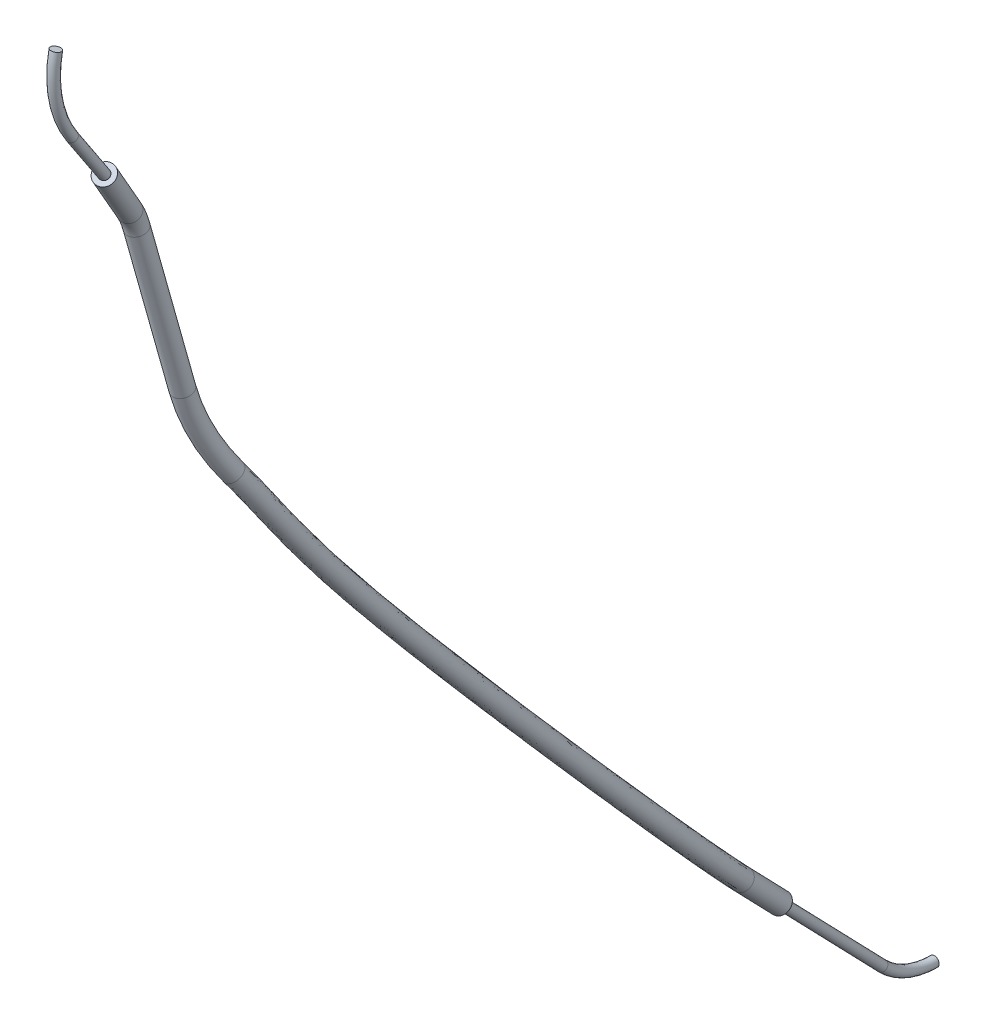
ISO-10303-21;
HEADER;
FILE_DESCRIPTION(('STEP AP214'),'2;1');
FILE_NAME('part.step','',(''),(''),'','','');
FILE_SCHEMA(('AUTOMOTIVE_DESIGN { 1 0 10303 214 1 1 1 1 }'));
ENDSEC;
DATA;
#1=APPLICATION_CONTEXT('core data for automotive mechanical design processes');
#2=APPLICATION_PROTOCOL_DEFINITION('international standard','automotive_design',2000,#1);
#3=PRODUCT_CONTEXT('',#1,'mechanical');
#4=PRODUCT('Part','Part','',(#3));
#5=PRODUCT_RELATED_PRODUCT_CATEGORY('part','',(#4));
#6=PRODUCT_DEFINITION_FORMATION('','',#4);
#7=PRODUCT_DEFINITION_CONTEXT('part definition',#1,'design');
#8=PRODUCT_DEFINITION('design','',#6,#7);
#9=PRODUCT_DEFINITION_SHAPE('','',#8);
#10=(LENGTH_UNIT() NAMED_UNIT(*) SI_UNIT(.MILLI.,.METRE.));
#11=(NAMED_UNIT(*) PLANE_ANGLE_UNIT() SI_UNIT($,.RADIAN.));
#12=(NAMED_UNIT(*) SI_UNIT($,.STERADIAN.) SOLID_ANGLE_UNIT());
#13=UNCERTAINTY_MEASURE_WITH_UNIT(LENGTH_MEASURE(1.E-05),#10,'distance_accuracy_value','');
#14=(GEOMETRIC_REPRESENTATION_CONTEXT(3) GLOBAL_UNCERTAINTY_ASSIGNED_CONTEXT((#13)) GLOBAL_UNIT_ASSIGNED_CONTEXT((#10,
#11,#12)) REPRESENTATION_CONTEXT('',''));
#15=CARTESIAN_POINT('',(0.,0.,0.));
#16=DIRECTION('',(0.,0.,1.));
#17=DIRECTION('',(1.,0.,0.));
#18=AXIS2_PLACEMENT_3D('',#15,#16,#17);
#19=CARTESIAN_POINT('',(0.,13.1111593528472,15.8448605333265));
#20=DIRECTION('',(0.,-0.719339800338635,-0.694658370459015));
#21=DIRECTION('',(0.,0.694658370459014,-0.719339800338635));
#22=AXIS2_PLACEMENT_3D('',#19,#20,#21);
#23=PLANE('',#22);
#24=CARTESIAN_POINT('',(0.,13.1111593528482,15.8448605333255));
#25=DIRECTION('',(0.,-0.719339800338635,-0.694658370459015));
#26=DIRECTION('',(0.,0.694658370459014,-0.719339800338635));
#27=AXIS2_PLACEMENT_3D('',#24,#25,#26);
#28=CIRCLE('',#27,0.5);
#29=CARTESIAN_POINT('',(0.,13.4584885380777,15.4851906331562));
#30=VERTEX_POINT('',#29);
#31=EDGE_CURVE('E49',#30,#30,#28,.T.);
#32=ORIENTED_EDGE('',*,*,#31,.F.);
#33=EDGE_LOOP('',(#32));
#34=FACE_BOUND('',#33,.T.);
#35=CARTESIAN_POINT('',(0.,13.1111593528472,15.8448605333265));
#36=DIRECTION('',(0.,-0.719339800338635,-0.694658370459015));
#37=DIRECTION('',(0.,0.694658370459014,-0.719339800338635));
#38=AXIS2_PLACEMENT_3D('',#35,#36,#37);
#39=CIRCLE('',#38,0.999999999999511);
#40=CARTESIAN_POINT('',(0.,13.8058177233058,15.1255207329882));
#41=VERTEX_POINT('',#40);
#42=EDGE_CURVE('E153',#41,#41,#39,.T.);
#43=ORIENTED_EDGE('',*,*,#42,.T.);
#44=EDGE_LOOP('',(#43));
#45=FACE_BOUND('',#44,.T.);
#46=ADVANCED_FACE('F45',(#34,#45),#23,.T.);
#47=CARTESIAN_POINT('',(-11.375,101.470537020685,74.0497627042893));
#48=DIRECTION('',(-0.173648177666929,-0.821217222698679,-0.543551822309542));
#49=DIRECTION('',(0.0943584669955078,0.535523513641116,-0.839232414795645));
#50=AXIS2_PLACEMENT_3D('',#47,#48,#49);
#51=PLANE('',#50);
#52=CARTESIAN_POINT('',(-11.3749999999999,101.470537020686,74.0497627042881));
#53=DIRECTION('',(-0.173648177666929,-0.821217222698679,-0.543551822309542));
#54=DIRECTION('',(0.984807753012208,-0.144802753384302,-0.0958428516863435));
#55=AXIS2_PLACEMENT_3D('',#52,#53,#54);
#56=ELLIPSE('',#55,0.507713305942873,0.5);
#57=CARTESIAN_POINT('',(-11.3750000000001,101.19456852803,74.4667056153217));
#58=VERTEX_POINT('',#57);
#59=CARTESIAN_POINT('',(-11.375,101.746505513342,73.6328197932546));
#60=VERTEX_POINT('',#59);
#61=EDGE_CURVE('E13',#58,#60,#56,.T.);
#62=ORIENTED_EDGE('',*,*,#61,.T.);
#63=CARTESIAN_POINT('',(-11.3749999999999,101.470537020686,74.0497627042881));
#64=DIRECTION('',(-0.173648177666929,-0.821217222698679,-0.543551822309542));
#65=DIRECTION('',(0.,0.5519369853121,-0.83388582206714));
#66=AXIS2_PLACEMENT_3D('',#63,#64,#65);
#67=CIRCLE('',#66,0.5);
#68=EDGE_CURVE('E85',#60,#58,#67,.T.);
#69=ORIENTED_EDGE('',*,*,#68,.T.);
#70=EDGE_LOOP('',(#62,#69));
#71=FACE_BOUND('',#70,.T.);
#72=CARTESIAN_POINT('',(-11.375,101.470537020685,74.0497627042893));
#73=DIRECTION('',(-0.173648177666929,-0.821217222698679,-0.543551822309542));
#74=DIRECTION('',(0.0943584669955078,0.535523513641116,-0.839232414795645));
#75=AXIS2_PLACEMENT_3D('',#72,#73,#74);
#76=CIRCLE('',#75,0.999999999999511);
#77=CARTESIAN_POINT('',(-11.2806415330046,102.006060534326,73.2105302894941));
#78=VERTEX_POINT('',#77);
#79=EDGE_CURVE('E81',#78,#78,#76,.T.);
#80=ORIENTED_EDGE('',*,*,#79,.F.);
#81=EDGE_LOOP('',(#80));
#82=FACE_BOUND('',#81,.T.);
#83=ADVANCED_FACE('F140',(#71,#82),#51,.F.);
#84=CARTESIAN_POINT('',(0.,13.1111593528472,15.8448605333265));
#85=DIRECTION('',(0.,0.719339800338642,0.694658370459007));
#86=DIRECTION('',(0.,-0.694658370459007,0.719339800338642));
#87=AXIS2_PLACEMENT_3D('',#84,#85,#86);
#88=CYLINDRICAL_SURFACE('',#87,0.999999999999511);
#89=CARTESIAN_POINT('',(0.,17.170747436117,19.7651591756809));
#90=DIRECTION('',(0.,-0.719339800338635,-0.694658370459015));
#91=DIRECTION('',(0.,0.694658370459014,-0.719339800338635));
#92=AXIS2_PLACEMENT_3D('',#89,#90,#91);
#93=CIRCLE('',#92,0.999999999999511);
#94=CARTESIAN_POINT('',(0.,17.8654058065757,19.0458193753426));
#95=VERTEX_POINT('',#94);
#96=EDGE_CURVE('E155',#95,#95,#93,.T.);
#97=ORIENTED_EDGE('',*,*,#96,.T.);
#98=EDGE_LOOP('',(#97));
#99=FACE_BOUND('',#98,.T.);
#100=ORIENTED_EDGE('',*,*,#42,.F.);
#101=EDGE_LOOP('',(#100));
#102=FACE_BOUND('',#101,.T.);
#103=ADVANCED_FACE('F143',(#99,#102),#88,.T.);
#104=CARTESIAN_POINT('',(0.,17.8654058065757,19.0458193753426));
#105=CARTESIAN_POINT('',(0.,18.0799133459049,19.2529668981844));
#106=CARTESIAN_POINT('',(-0.00749146107605446,18.3077487449941,19.4698881451671));
#107=CARTESIAN_POINT('',(-0.0358580609070674,18.7965767756348,19.9301346253102));
#108=CARTESIAN_POINT('',(-0.0567342490146542,19.0557707906016,20.171722533152));
#109=CARTESIAN_POINT('',(-0.137177252180344,19.8716222228172,20.9258430646425));
#110=CARTESIAN_POINT('',(-0.214530932234064,20.4664565945145,21.46765020807));
#111=CARTESIAN_POINT('',(-0.500708798210788,22.3578028106722,23.1721953552096));
#112=CARTESIAN_POINT('',(-0.763482930006202,23.7634680288247,24.4163089960345));
#113=CARTESIAN_POINT('',(-1.66699011878649,28.1664198806543,28.2697581724947));
#114=CARTESIAN_POINT('',(-2.41951925371011,31.3486105813104,31.0003617954818));
#115=CARTESIAN_POINT('',(-4.68922980220798,40.6278683157976,38.8674219982044));
#116=CARTESIAN_POINT('',(-6.24090831226144,46.5452781294316,43.7604300346031));
#117=CARTESIAN_POINT('',(-8.29703948873135,55.2601616106186,50.7057083676437));
#118=CARTESIAN_POINT('',(-8.89188787445537,58.3411488256507,53.0093120536888));
#119=CARTESIAN_POINT('',(-9.6321193444375,62.3237651472189,55.7680985954605));
#120=CARTESIAN_POINT('',(-9.8542073899737,63.547332719236,56.5720305822303));
#121=CARTESIAN_POINT('',(-10.2592659521528,65.4262720578813,57.776392084434));
#122=CARTESIAN_POINT('',(-10.4065375133106,66.0595425383804,58.1777555696156));
#123=CARTESIAN_POINT('',(-10.6730524721802,67.0761928683995,58.8265252424002));
#124=CARTESIAN_POINT('',(-10.7695712818076,67.426152247486,59.0505930960422));
#125=CARTESIAN_POINT('',(-10.9297224020711,67.9741967049277,59.4045179952518));
#126=CARTESIAN_POINT('',(-10.985671323153,68.1607243945093,59.5254650735618));
#127=CARTESIAN_POINT('',(-11.10334186882,68.5425078979222,59.7743409124543));
#128=CARTESIAN_POINT('',(-11.1663895500006,68.7418466666541,59.9049618264803));
#129=CARTESIAN_POINT('',(-11.2299947849779,68.9378878999835,60.0342120072733));
#130=CARTESIAN_POINT('',(1.99999999999902,17.8654058065757,19.0458193753426));
#131=CARTESIAN_POINT('',(1.99999999999902,18.0920701219509,19.2647065603498));
#132=CARTESIAN_POINT('',(1.99171482882098,18.3518051747756,19.512103962075));
#133=CARTESIAN_POINT('',(1.96137023741766,18.8747195847153,20.0044431752558));
#134=CARTESIAN_POINT('',(1.93927996595546,19.1482117186935,20.2593314054861));
#135=CARTESIAN_POINT('',(1.85512604597813,20.0016993247474,21.0482402099578));
#136=CARTESIAN_POINT('',(1.77522239402711,20.6147650894629,21.6065748606663));
#137=CARTESIAN_POINT('',(1.48222847568851,22.5511585645962,23.3517180370856));
#138=CARTESIAN_POINT('',(1.21588576517648,23.9743286520974,24.6111844922362));
#139=CARTESIAN_POINT('',(0.303947956499712,28.4183647038713,28.5005898888944));
#140=CARTESIAN_POINT('',(-0.451541054799335,31.6119624782822,31.2408201229174));
#141=CARTESIAN_POINT('',(-2.72709069545169,40.9150929287244,39.1281184279889));
#142=CARTESIAN_POINT('',(-4.27946366370087,46.8358628555906,44.0233366525643));
#143=CARTESIAN_POINT('',(-6.32566561722083,55.508661463589,50.9350756768151));
#144=CARTESIAN_POINT('',(-6.91488705899755,58.5605828219199,53.2174615689979));
#145=CARTESIAN_POINT('',(-7.65582513216861,62.5469965710675,55.978886045005));
#146=CARTESIAN_POINT('',(-7.8799272842074,63.7832748935517,56.7915631698015));
#147=CARTESIAN_POINT('',(-8.29585167078003,65.7126015869154,58.0282473225595));
#148=CARTESIAN_POINT('',(-8.44810087503084,66.3675334560869,58.4433541624192));
#149=CARTESIAN_POINT('',(-8.72419136365745,67.4206993766711,59.1154446366712));
#150=CARTESIAN_POINT('',(-8.8242391818918,67.7834445817404,59.3477017785631));
#151=CARTESIAN_POINT('',(-8.99002624380742,68.3507714676473,59.7140860035596));
#152=CARTESIAN_POINT('',(-9.0479093668769,68.5437435998558,59.8392116683875));
#153=CARTESIAN_POINT('',(-9.16951823115978,68.9383021725637,60.096420199611));
#154=CARTESIAN_POINT('',(-9.23714074248978,69.1518961007432,60.2364177311673));
#155=CARTESIAN_POINT('',(-9.30019034096967,69.3462247759119,60.3645388206557));
#156=CARTESIAN_POINT('',(1.99999999999902,16.4760890656584,20.4844989760192));
#157=CARTESIAN_POINT('',(1.99999999999902,16.7063679904558,20.7068767487707));
#158=CARTESIAN_POINT('',(1.99147868370641,16.975637590795,20.9633836796663));
#159=CARTESIAN_POINT('',(1.96053702693069,17.5088489561556,21.4654177902103));
#160=CARTESIAN_POINT('',(1.93807721931826,17.786705077923,21.7243658981411));
#161=CARTESIAN_POINT('',(1.85278021707493,18.6517871778568,22.5239919063525));
#162=CARTESIAN_POINT('',(1.77207369825999,19.2706294857348,23.0875654483022));
#163=CARTESIAN_POINT('',(1.4768683808729,21.2216384851036,24.8458806294111));
#164=CARTESIAN_POINT('',(1.20927714493608,22.6510331572573,26.1108160885573));
#165=CARTESIAN_POINT('',(0.294116526438554,27.1107765367347,30.0139684895423));
#166=CARTESIAN_POINT('',(-0.462926649480622,30.3106641908858,32.7595564643571));
#167=CARTESIAN_POINT('',(-2.74297691676848,39.632199177327,40.6624583538728));
#168=CARTESIAN_POINT('',(-4.29751529057615,45.5604047019331,45.5641120559931));
#169=CARTESIAN_POINT('',(-6.35522882551133,54.2819949920938,52.5147353423174));
#170=CARTESIAN_POINT('',(-6.95201196096079,57.3705610753969,54.8254531871227));
#171=CARTESIAN_POINT('',(-7.70570581561108,61.4255704307978,57.6343941525733));
#172=CARTESIAN_POINT('',(-7.93443515065044,62.6862058726061,58.4629705333535));
#173=CARTESIAN_POINT('',(-8.353482808576,64.6299195664686,59.7088757241867));
#174=CARTESIAN_POINT('',(-8.5060327066885,65.2856727437063,60.1244986643255));
#175=CARTESIAN_POINT('',(-8.7805028907963,66.3325970379448,60.7926055400863));
#176=CARTESIAN_POINT('',(-8.8796592642708,66.6920488358835,61.0227577298989));
#177=CARTESIAN_POINT('',(-9.04354276460572,67.2528416817003,61.38492210924));
#178=CARTESIAN_POINT('',(-9.10069516297291,67.4433742718581,61.5084665278113));
#179=CARTESIAN_POINT('',(-9.22066605368021,67.8326047585894,61.7622016717539));
#180=CARTESIAN_POINT('',(-9.28472984778983,68.0351438913845,61.8949230448606));
#181=CARTESIAN_POINT('',(-9.34943499238236,68.2345752173314,62.0264083170998));
#182=CARTESIAN_POINT('',(0.,16.4760890656584,20.4844989760192));
#183=CARTESIAN_POINT('',(0.,16.6942112144098,20.6951370866053));
#184=CARTESIAN_POINT('',(-0.00772760619062775,16.9315811610134,20.9211678627581));
#185=CARTESIAN_POINT('',(-0.036691271394035,17.4307061470751,21.3911092402649));
#186=CARTESIAN_POINT('',(-0.0579369956518758,17.6942641498312,21.636757025807));
#187=CARTESIAN_POINT('',(-0.139523081083501,18.5217100759266,22.4015947610373));
#188=CARTESIAN_POINT('',(-0.217679628001466,19.122320990785,22.9486407957066));
#189=CARTESIAN_POINT('',(-0.506068893025839,21.0282827311825,24.6663579475336));
#190=CARTESIAN_POINT('',(-0.770091550245744,22.4401725339846,25.9159405923556));
#191=CARTESIAN_POINT('',(-1.67682154884936,26.8588317135178,29.7831367731426));
#192=CARTESIAN_POINT('',(-2.43090484839072,30.0473122939139,32.5190981369143));
#193=CARTESIAN_POINT('',(-4.70511602352611,39.3449745644002,40.4017619241025));
#194=CARTESIAN_POINT('',(-6.25895993913415,45.2698199757741,45.3012054380421));
#195=CARTESIAN_POINT('',(-8.3266026970242,54.0334951391234,52.2853680331367));
#196=CARTESIAN_POINT('',(-8.9290127764179,57.151127079122,54.6173036718137));
#197=CARTESIAN_POINT('',(-9.68200002788032,61.2023390069521,57.4236067030288));
#198=CARTESIAN_POINT('',(-9.90871525641674,62.4502636982852,58.2434379457796));
#199=CARTESIAN_POINT('',(-10.3168970899487,64.3435900374371,59.4570204860624));
#200=CARTESIAN_POINT('',(-10.4644693449679,64.9776818259999,59.8589000715234));
#201=CARTESIAN_POINT('',(-10.7293639993192,65.9880905296733,60.5036861458146));
#202=CARTESIAN_POINT('',(-10.8249913641868,66.3347565016291,60.7256490473787));
#203=CARTESIAN_POINT('',(-10.9832389228693,66.8762669189806,61.0753541009318));
#204=CARTESIAN_POINT('',(-11.0384571192489,67.0603550665124,61.1947199329852));
#205=CARTESIAN_POINT('',(-11.1544896913405,67.4368104839471,61.4401223845976));
#206=CARTESIAN_POINT('',(-11.2139786553006,67.6250944572954,61.5634671401736));
#207=CARTESIAN_POINT('',(-11.2792394363906,67.826238341403,61.6960815037174));
#208=CARTESIAN_POINT('',(-1.99999999999902,16.4760890656584,20.4844989760192));
#209=CARTESIAN_POINT('',(-1.99999999999902,16.6820544383639,20.6833974244399));
#210=CARTESIAN_POINT('',(-2.00693389608766,16.8875247312318,20.8789520458499));
#211=CARTESIAN_POINT('',(-2.03391956971876,17.3525633379946,21.3168006903196));
#212=CARTESIAN_POINT('',(-2.05395121062201,17.6018232217393,21.5491481534729));
#213=CARTESIAN_POINT('',(-2.13182637924193,18.3916329739964,22.279197615722));
#214=CARTESIAN_POINT('',(-2.20743295426292,18.9740124958351,22.809716143111));
#215=CARTESIAN_POINT('',(-2.48900616692458,20.8349269772614,24.4868352656562));
#216=CARTESIAN_POINT('',(-2.74946024542757,22.2293119107118,25.7210650961539));
#217=CARTESIAN_POINT('',(-3.64775962413727,26.6068868903008,29.5523050567429));
#218=CARTESIAN_POINT('',(-4.39888304730082,29.7839603969421,32.2786398094715));
#219=CARTESIAN_POINT('',(-6.66725513028375,39.0577499514734,40.1410654943323));
#220=CARTESIAN_POINT('',(-8.22040458769214,44.979235249615,45.0382988200912));
#221=CARTESIAN_POINT('',(-10.2979765685371,53.7849952861529,52.056000723956));
#222=CARTESIAN_POINT('',(-10.906013591875,56.9316930828471,54.4091541565046));
#223=CARTESIAN_POINT('',(-11.6582942401496,60.9791075831064,57.2128192534843));
#224=CARTESIAN_POINT('',(-11.882995362183,62.2143215239642,58.0239053582058));
#225=CARTESIAN_POINT('',(-12.2803113713215,64.0572605084057,59.2051652479382));
#226=CARTESIAN_POINT('',(-12.4229059832473,64.6696909082934,59.5933014787212));
#227=CARTESIAN_POINT('',(-12.6782251078422,65.6435840214018,60.2147667515428));
#228=CARTESIAN_POINT('',(-12.7703234641028,65.9774641673746,60.4285403648586));
#229=CARTESIAN_POINT('',(-12.9229350811328,66.499692156261,60.7657860926236));
#230=CARTESIAN_POINT('',(-12.9762190755248,66.6773358611668,60.8809733381591));
#231=CARTESIAN_POINT('',(-13.0883133290008,67.0410162093048,61.1180430974414));
#232=CARTESIAN_POINT('',(-13.1432274628115,67.2150450232062,61.2320112354866));
#233=CARTESIAN_POINT('',(-13.2090438803988,67.4179014654747,61.365754690335));
#234=CARTESIAN_POINT('',(-1.99999999999902,17.8654058065757,19.0458193753426));
#235=CARTESIAN_POINT('',(-1.99999999999902,18.067756569859,19.2412272360189));
#236=CARTESIAN_POINT('',(-2.00669775097309,18.2636923152125,19.4276723282592));
#237=CARTESIAN_POINT('',(-2.0330863592318,18.7184339665543,19.8558260753646));
#238=CARTESIAN_POINT('',(-2.05274846398477,18.9633298625097,20.0841136608179));
#239=CARTESIAN_POINT('',(-2.12948055033882,19.741545120887,20.8034459193273));
#240=CARTESIAN_POINT('',(-2.20428425849524,20.3181480995662,21.3287255554736));
#241=CARTESIAN_POINT('',(-2.48364607211009,22.1644470567481,22.9926726733336));
#242=CARTESIAN_POINT('',(-2.74285162518889,23.5526074055519,24.2214334998328));
#243=CARTESIAN_POINT('',(-3.63792819407269,27.9144750574373,28.038926456095));
#244=CARTESIAN_POINT('',(-4.38749745262088,31.0852586843386,30.7599034680462));
#245=CARTESIAN_POINT('',(-6.65136890896428,40.3406437028708,38.6067255684198));
#246=CARTESIAN_POINT('',(-8.20235296082202,46.2546934032725,43.4975234166418));
#247=CARTESIAN_POINT('',(-10.2684133602419,55.0116617576482,50.4763410584724));
#248=CARTESIAN_POINT('',(-10.8688886899132,58.1217148293815,52.8011625383798));
#249=CARTESIAN_POINT('',(-11.6084135567064,62.1005337233704,55.557311145916));
#250=CARTESIAN_POINT('',(-11.82848749574,63.3113905449203,56.3524979946591));
#251=CARTESIAN_POINT('',(-12.2226802335255,65.1399425288473,57.5245368463084));
#252=CARTESIAN_POINT('',(-12.3649741515904,65.751551620674,57.912156976812));
#253=CARTESIAN_POINT('',(-12.621913580703,66.731686360128,58.5376058481292));
#254=CARTESIAN_POINT('',(-12.7149033817234,67.0688599132316,58.7534844135213));
#255=CARTESIAN_POINT('',(-12.8694185603347,67.597621942208,59.094949986944));
#256=CARTESIAN_POINT('',(-12.923433279429,67.7777051891629,59.2117184787361));
#257=CARTESIAN_POINT('',(-13.0371655064802,68.1467136232807,59.4522616252976));
#258=CARTESIAN_POINT('',(-13.0956383575114,68.3317972325649,59.5735059217933));
#259=CARTESIAN_POINT('',(-13.1597992289861,68.5295510240551,59.7038851938909));
#260=CARTESIAN_POINT('',(0.,17.8654058065757,19.0458193753426));
#261=CARTESIAN_POINT('',(0.,18.0799133459049,19.2529668981844));
#262=CARTESIAN_POINT('',(-0.00749146107605446,18.3077487449941,19.4698881451671));
#263=CARTESIAN_POINT('',(-0.0358580609070674,18.7965767756348,19.9301346253102));
#264=CARTESIAN_POINT('',(-0.0567342490146542,19.0557707906016,20.171722533152));
#265=CARTESIAN_POINT('',(-0.137177252180344,19.8716222228172,20.9258430646425));
#266=CARTESIAN_POINT('',(-0.214530932234064,20.4664565945145,21.46765020807));
#267=CARTESIAN_POINT('',(-0.500708798210788,22.3578028106722,23.1721953552096));
#268=CARTESIAN_POINT('',(-0.763482930006202,23.7634680288247,24.4163089960345));
#269=CARTESIAN_POINT('',(-1.66699011878649,28.1664198806543,28.2697581724947));
#270=CARTESIAN_POINT('',(-2.41951925371011,31.3486105813104,31.0003617954818));
#271=CARTESIAN_POINT('',(-4.68922980220798,40.6278683157976,38.8674219982044));
#272=CARTESIAN_POINT('',(-6.24090831226144,46.5452781294316,43.7604300346031));
#273=CARTESIAN_POINT('',(-8.29703948873135,55.2601616106186,50.7057083676437));
#274=CARTESIAN_POINT('',(-8.89188787445537,58.3411488256507,53.0093120536888));
#275=CARTESIAN_POINT('',(-9.6321193444375,62.3237651472189,55.7680985954605));
#276=CARTESIAN_POINT('',(-9.8542073899737,63.547332719236,56.5720305822303));
#277=CARTESIAN_POINT('',(-10.2592659521528,65.4262720578813,57.776392084434));
#278=CARTESIAN_POINT('',(-10.4065375133106,66.0595425383804,58.1777555696156));
#279=CARTESIAN_POINT('',(-10.6730524721802,67.0761928683995,58.8265252424002));
#280=CARTESIAN_POINT('',(-10.7695712818076,67.426152247486,59.0505930960422));
#281=CARTESIAN_POINT('',(-10.9297224020711,67.9741967049277,59.4045179952518));
#282=CARTESIAN_POINT('',(-10.985671323153,68.1607243945093,59.5254650735618));
#283=CARTESIAN_POINT('',(-11.10334186882,68.5425078979222,59.7743409124543));
#284=CARTESIAN_POINT('',(-11.1663895500006,68.7418466666541,59.9049618264803));
#285=CARTESIAN_POINT('',(-11.2299947849779,68.9378878999835,60.0342120072733));
#286=(BOUNDED_SURFACE() B_SPLINE_SURFACE(3,3,((#104,#105,#106,#107,#108,#109,#110,#111,#112,
#113,#114,#115,#116,#117,#118,#119,#120,#121,#122,#123,#124,#125,#126,#127,#128,#129),(#130,
#131,#132,#133,#134,#135,#136,#137,#138,#139,#140,#141,#142,#143,#144,#145,#146,#147,#148,#149,
#150,#151,#152,#153,#154,#155),(#156,#157,#158,#159,#160,#161,#162,#163,#164,#165,#166,#167,
#168,#169,#170,#171,#172,#173,#174,#175,#176,#177,#178,#179,#180,#181),(#182,#183,#184,#185,
#186,#187,#188,#189,#190,#191,#192,#193,#194,#195,#196,#197,#198,#199,#200,#201,#202,#203,#204,
#205,#206,#207),(#208,#209,#210,#211,#212,#213,#214,#215,#216,#217,#218,#219,#220,#221,#222,
#223,#224,#225,#226,#227,#228,#229,#230,#231,#232,#233),(#234,#235,#236,#237,#238,#239,#240,
#241,#242,#243,#244,#245,#246,#247,#248,#249,#250,#251,#252,#253,#254,#255,#256,#257,#258,#259),
(#260,#261,#262,#263,#264,#265,#266,#267,#268,#269,#270,#271,#272,#273,#274,#275,#276,#277,#278,
#279,#280,#281,#282,#283,#284,#285)),.UNSPECIFIED.,.T.,.F.,.F.) B_SPLINE_SURFACE_WITH_KNOTS((4,
3,4),(4,2,2,2,2,2,2,2,2,2,2,2,4),(0.,0.5,1.),(0.0519837529824369,0.0620652435304384,
0.0721467340784399,0.0923097151744429,0.132635677366449,0.213287601750461,0.374591450518485,
0.520702058241909,0.593757362103621,0.630285014034478,0.648548839999906,0.65768075298262,
0.666812665965334),
.UNSPECIFIED.) GEOMETRIC_REPRESENTATION_ITEM() RATIONAL_B_SPLINE_SURFACE(((1.,1.,1.,1.,1.,1.,1.,
1.,1.,1.,1.,1.,1.,1.,1.,1.,1.,1.,1.,1.,1.,1.,1.,1.,1.,1.),(0.333333333333333,0.333333333333333,
0.333333333333333,0.333333333333333,0.333333333333333,0.333333333333333,0.333333333333333,
0.333333333333333,0.333333333333333,0.333333333333333,0.333333333333333,0.333333333333333,
0.333333333333333,0.333333333333333,0.333333333333333,0.333333333333333,0.333333333333333,
0.333333333333333,0.333333333333333,0.333333333333333,0.333333333333333,0.333333333333333,
0.333333333333333,0.333333333333333,0.333333333333333,0.333333333333333),(0.333333333333333,
0.333333333333333,0.333333333333333,0.333333333333333,0.333333333333333,0.333333333333333,
0.333333333333333,0.333333333333333,0.333333333333333,0.333333333333333,0.333333333333333,
0.333333333333333,0.333333333333333,0.333333333333333,0.333333333333333,0.333333333333333,
0.333333333333333,0.333333333333333,0.333333333333333,0.333333333333333,0.333333333333333,
0.333333333333333,0.333333333333333,0.333333333333333,0.333333333333333,0.333333333333333),(1.,
1.,1.,1.,1.,1.,1.,1.,1.,1.,1.,1.,1.,1.,1.,1.,1.,1.,1.,1.,1.,1.,1.,1.,1.,1.),(0.333333333333333,
0.333333333333333,0.333333333333333,0.333333333333333,0.333333333333333,0.333333333333333,
0.333333333333333,0.333333333333333,0.333333333333333,0.333333333333333,0.333333333333333,
0.333333333333333,0.333333333333333,0.333333333333333,0.333333333333333,0.333333333333333,
0.333333333333333,0.333333333333333,0.333333333333333,0.333333333333333,0.333333333333333,
0.333333333333333,0.333333333333333,0.333333333333333,0.333333333333333,0.333333333333333),
(0.333333333333333,0.333333333333333,0.333333333333333,0.333333333333333,0.333333333333333,
0.333333333333333,0.333333333333333,0.333333333333333,0.333333333333333,0.333333333333333,
0.333333333333333,0.333333333333333,0.333333333333333,0.333333333333333,0.333333333333333,
0.333333333333333,0.333333333333333,0.333333333333333,0.333333333333333,0.333333333333333,
0.333333333333333,0.333333333333333,0.333333333333333,0.333333333333333,0.333333333333333,
0.333333333333333),(1.,1.,1.,1.,1.,1.,1.,1.,1.,1.,1.,1.,1.,1.,1.,1.,1.,1.,1.,1.,1.,1.,1.,1.,1.,1.))) REPRESENTATION_ITEM('') SURFACE());
#287=CARTESIAN_POINT('',(-11.2546171106842,68.3820631206933,60.8651467554953));
#288=DIRECTION('',(0.261452563665855,-0.80583749209496,-0.531289462804089));
#289=DIRECTION('',(0.0246223257063602,0.555824779290499,-0.830934748222432));
#290=AXIS2_PLACEMENT_3D('',#287,#288,#289);
#291=CIRCLE('',#290,0.999999999999511);
#292=CARTESIAN_POINT('',(-11.8415274445321,67.8123494933781,61.4404402830731));
#293=VERTEX_POINT('',#292);
#294=EDGE_CURVE('E158',#293,#293,#291,.T.);
#295=ORIENTED_EDGE('',*,*,#294,.T.);
#296=EDGE_LOOP('',(#295));
#297=FACE_BOUND('',#296,.T.);
#298=ORIENTED_EDGE('',*,*,#96,.F.);
#299=EDGE_LOOP('',(#298));
#300=FACE_BOUND('',#299,.T.);
#301=ADVANCED_FACE('F176',(#297,#300),#286,.F.);
#302=CARTESIAN_POINT('',(2.9600173376667,82.1802031183921,46.9318647473102));
#303=DIRECTION('',(-0.766275940490601,0.161407308338699,-0.621907439929851));
#304=DIRECTION('',(-0.630170310861629,0.,0.776456939764568));
#305=AXIS2_PLACEMENT_3D('',#302,#303,#304);
#306=TOROIDAL_SURFACE('',#305,24.2194311951366,0.999999999999511);
#307=CARTESIAN_POINT('',(-12.5991041692694,77.1294630804313,64.7920050160005));
#308=DIRECTION('',(0.0106664618734066,-0.96460271991491,-0.263491592510768));
#309=DIRECTION('',(0.0695400970126404,0.263584174662062,-0.962126580952418));
#310=AXIS2_PLACEMENT_3D('',#307,#308,#309);
#311=CIRCLE('',#310,0.999999999999511);
#312=CARTESIAN_POINT('',(-13.2415272460778,76.920922260572,65.5294352275023));
#313=VERTEX_POINT('',#312);
#314=EDGE_CURVE('E163',#313,#313,#311,.T.);
#315=CARTESIAN_POINT('',(2.9600173376667,82.1802031183921,46.9318647473102));
#316=DIRECTION('',(-0.766275940490601,0.161407308338699,-0.621907439929851));
#317=DIRECTION('',(-0.630170310861629,0.,0.776456939764568));
#318=AXIS2_PLACEMENT_3D('',#315,#316,#317);
#319=CIRCLE('',#318,25.2194311951361);
#320=EDGE_CURVE('',#293,#313,#319,.T.);
#321=ORIENTED_EDGE('',*,*,#294,.F.);
#322=ORIENTED_EDGE('',*,*,#314,.T.);
#323=ORIENTED_EDGE('',*,*,#320,.T.);
#324=ORIENTED_EDGE('',*,*,#320,.F.);
#325=EDGE_LOOP('',(#321,#323,#322,#324));
#326=FACE_BOUND('',#325,.T.);
#327=ADVANCED_FACE('F171',(#326),#306,.T.);
#328=CARTESIAN_POINT('',(-12.5991041692694,77.1294630804313,64.7920050160005));
#329=DIRECTION('',(-0.0106664618734065,0.964602719914913,0.263491592510759));
#330=DIRECTION('',(0.,-0.263506582958254,0.964657597667517));
#331=AXIS2_PLACEMENT_3D('',#328,#329,#330);
#332=CYLINDRICAL_SURFACE('',#331,0.999999999999511);
#333=CARTESIAN_POINT('',(-12.7820804158944,93.6765981350536,69.3120326678172));
#334=DIRECTION('',(0.0106664618734073,-0.96460271991491,-0.263491592510769));
#335=DIRECTION('',(0.0695400970126404,0.263584174662063,-0.962126580952418));
#336=AXIS2_PLACEMENT_3D('',#333,#334,#335);
#337=CIRCLE('',#336,0.999999999999511);
#338=CARTESIAN_POINT('',(-13.2941841543366,93.8976559993902,68.4820427993927));
#339=VERTEX_POINT('',#338);
#340=EDGE_CURVE('E91',#339,#339,#337,.T.);
#341=ORIENTED_EDGE('',*,*,#340,.T.);
#342=EDGE_LOOP('',(#341));
#343=FACE_BOUND('',#342,.T.);
#344=ORIENTED_EDGE('',*,*,#314,.F.);
#345=EDGE_LOOP('',(#344));
#346=FACE_BOUND('',#345,.T.);
#347=ADVANCED_FACE('F135',(#343,#346),#332,.T.);
#348=CARTESIAN_POINT('',(-9.68156335811037,92.3382097819088,74.3371819718753));
#349=DIRECTION('',(0.858857373295688,0.143788084859783,-0.491618753698419));
#350=DIRECTION('',(-0.49678105316397,0.,-0.86787590427278));
#351=AXIS2_PLACEMENT_3D('',#348,#349,#350);
#352=TOROIDAL_SURFACE('',#351,6.05447065708622,0.999999999999511);
#353=CARTESIAN_POINT('',(-12.5991041692694,95.6815017443723,70.218083841645));
#354=DIRECTION('',(-0.173648177666929,-0.82121722269868,-0.54355182230954));
#355=DIRECTION('',(0.0943584669955074,0.535523513641114,-0.839232414795646));
#356=AXIS2_PLACEMENT_3D('',#353,#354,#355);
#357=CIRCLE('',#356,0.999999999999511);
#358=CARTESIAN_POINT('',(-13.0809862323599,96.2337039354175,69.5377439137593));
#359=VERTEX_POINT('',#358);
#360=EDGE_CURVE('E86',#359,#359,#357,.T.);
#361=CARTESIAN_POINT('',(-9.68156335811037,92.3382097819088,74.3371819718753));
#362=DIRECTION('',(0.858857373295688,0.143788084859783,-0.491618753698419));
#363=DIRECTION('',(-0.49678105316397,0.,-0.86787590427278));
#364=AXIS2_PLACEMENT_3D('',#361,#362,#363);
#365=CIRCLE('',#364,7.05447065708574);
#366=EDGE_CURVE('',#339,#359,#365,.T.);
#367=ORIENTED_EDGE('',*,*,#340,.F.);
#368=ORIENTED_EDGE('',*,*,#360,.T.);
#369=ORIENTED_EDGE('',*,*,#366,.T.);
#370=ORIENTED_EDGE('',*,*,#366,.F.);
#371=EDGE_LOOP('',(#367,#369,#368,#370));
#372=FACE_BOUND('',#371,.T.);
#373=ADVANCED_FACE('F128',(#372),#352,.T.);
#374=CARTESIAN_POINT('',(-12.5991041692694,95.6815017443723,70.218083841645));
#375=DIRECTION('',(0.17364817766693,0.821217222698684,0.543551822309533));
#376=DIRECTION('',(0.,-0.551936985312091,0.833885822067146));
#377=AXIS2_PLACEMENT_3D('',#374,#375,#376);
#378=CYLINDRICAL_SURFACE('',#377,0.999999999999511);
#379=ORIENTED_EDGE('',*,*,#79,.T.);
#380=EDGE_LOOP('',(#379));
#381=FACE_BOUND('',#380,.T.);
#382=ORIENTED_EDGE('',*,*,#360,.F.);
#383=EDGE_LOOP('',(#382));
#384=FACE_BOUND('',#383,.T.);
#385=ADVANCED_FACE('F82',(#381,#384),#378,.T.);
#386=CARTESIAN_POINT('',(-11.3749999999999,115.113858529973,79.0408317655282));
#387=DIRECTION('',(0.,0.979924704620835,-0.199367934417172));
#388=DIRECTION('',(0.995399469177943,0.0191017962276908,0.0938883280346435));
#389=AXIS2_PLACEMENT_3D('',#386,#387,#388);
#390=PLANE('',#389);
#391=CARTESIAN_POINT('',(-11.3749999999999,115.113858529973,79.0408317655282));
#392=DIRECTION('',(0.,0.979924704620835,-0.199367934417172));
#393=DIRECTION('',(0.995399469177943,0.0191017962276908,0.0938883280346435));
#394=AXIS2_PLACEMENT_3D('',#391,#392,#393);
#395=CIRCLE('',#394,0.5);
#396=CARTESIAN_POINT('',(-10.8773002654109,115.123409428087,79.0877759295455));
#397=VERTEX_POINT('',#396);
#398=EDGE_CURVE('E54',#397,#397,#395,.T.);
#399=ORIENTED_EDGE('',*,*,#398,.T.);
#400=EDGE_LOOP('',(#399));
#401=FACE_BOUND('',#400,.T.);
#402=ADVANCED_FACE('F122',(#401),#390,.T.);
#403=CARTESIAN_POINT('',(-11.3749999999999,112.821127284177,67.7716976623897));
#404=DIRECTION('',(1.,0.,0.));
#405=DIRECTION('',(0.,0.,-1.));
#406=AXIS2_PLACEMENT_3D('',#403,#404,#405);
#407=TOROIDAL_SURFACE('',#406,11.4999999999986,0.5);
#408=CARTESIAN_POINT('',(-11.3749999999999,106.473851953088,77.36138461616));
#409=DIRECTION('',(0.,0.833885822067153,0.551936985312081));
#410=DIRECTION('',(0.995399469177943,-0.0528820637821199,0.0798960830730072));
#411=AXIS2_PLACEMENT_3D('',#408,#409,#410);
#412=CIRCLE('',#411,0.5);
#413=CARTESIAN_POINT('',(-10.8773002654109,106.447410921197,77.4013326576965));
#414=VERTEX_POINT('',#413);
#415=EDGE_CURVE('E95',#414,#414,#412,.T.);
#416=ORIENTED_EDGE('',*,*,#415,.T.);
#417=EDGE_LOOP('',(#416));
#418=FACE_BOUND('',#417,.T.);
#419=ORIENTED_EDGE('',*,*,#398,.F.);
#420=EDGE_LOOP('',(#419));
#421=FACE_BOUND('',#420,.T.);
#422=ADVANCED_FACE('F113',(#418,#421),#407,.T.);
#423=CARTESIAN_POINT('',(-11.3749999999999,106.473851953088,77.36138461616));
#424=DIRECTION('',(0.,-0.83388582206715,-0.551936985312086));
#425=DIRECTION('',(0.,0.551936985312086,-0.83388582206715));
#426=AXIS2_PLACEMENT_3D('',#423,#424,#425);
#427=CYLINDRICAL_SURFACE('',#426,0.5);
#428=ORIENTED_EDGE('',*,*,#415,.F.);
#429=EDGE_LOOP('',(#428));
#430=FACE_BOUND('',#429,.T.);
#431=ORIENTED_EDGE('',*,*,#61,.F.);
#432=CARTESIAN_POINT('',(-11.3749999999999,101.470537020686,74.0497627042882));
#433=DIRECTION('',(-0.087155742747658,-0.83071263475717,-0.549836698448644));
#434=DIRECTION('',(0.996194698091746,-0.072677938189023,-0.048104477904749));
#435=AXIS2_PLACEMENT_3D('',#432,#433,#434);
#436=ELLIPSE('',#435,0.501909918771674,0.5);
#437=CARTESIAN_POINT('',(-10.8749999999999,101.434059242633,74.0256185896904));
#438=VERTEX_POINT('',#437);
#439=EDGE_CURVE('E98',#438,#58,#436,.T.);
#440=ORIENTED_EDGE('',*,*,#439,.F.);
#441=EDGE_CURVE('E102',#60,#438,#436,.T.);
#442=ORIENTED_EDGE('',*,*,#441,.F.);
#443=EDGE_LOOP('',(#431,#440,#442));
#444=FACE_BOUND('',#443,.T.);
#445=ADVANCED_FACE('F111',(#430,#444),#427,.T.);
#446=CARTESIAN_POINT('',(-11.3402703644667,101.634780465225,74.1584730687494));
#447=DIRECTION('',(-0.17364817766693,-0.821217222698684,-0.543551822309533));
#448=DIRECTION('',(0.,0.551936985312091,-0.833885822067146));
#449=AXIS2_PLACEMENT_3D('',#446,#447,#448);
#450=CYLINDRICAL_SURFACE('',#449,0.5);
#451=ORIENTED_EDGE('',*,*,#68,.F.);
#452=ORIENTED_EDGE('',*,*,#441,.T.);
#453=ORIENTED_EDGE('',*,*,#439,.T.);
#454=EDGE_LOOP('',(#451,#452,#453));
#455=FACE_BOUND('',#454,.T.);
#456=ADVANCED_FACE('F110',(#455),#450,.T.);
#457=CARTESIAN_POINT('',(0.,0.,0.));
#458=DIRECTION('',(0.,0.,1.));
#459=DIRECTION('',(1.,0.,0.));
#460=AXIS2_PLACEMENT_3D('',#457,#458,#459);
#461=PLANE('',#460);
#462=CARTESIAN_POINT('',(0.,0.,0.));
#463=DIRECTION('',(0.,0.,1.));
#464=DIRECTION('',(1.,0.,0.));
#465=AXIS2_PLACEMENT_3D('',#462,#463,#464);
#466=CIRCLE('',#465,0.5);
#467=CARTESIAN_POINT('',(0.5,0.,0.));
#468=VERTEX_POINT('',#467);
#469=EDGE_CURVE('E65',#468,#468,#466,.T.);
#470=ORIENTED_EDGE('',*,*,#469,.F.);
#471=EDGE_LOOP('',(#470));
#472=FACE_BOUND('',#471,.T.);
#473=ADVANCED_FACE('F47',(#472),#461,.F.);
#474=CARTESIAN_POINT('',(0.,17.1707474361171,19.7651591756791));
#475=DIRECTION('',(0.,-0.719339800338634,-0.694658370459015));
#476=DIRECTION('',(0.,0.694658370459015,-0.719339800338634));
#477=AXIS2_PLACEMENT_3D('',#474,#475,#476);
#478=CYLINDRICAL_SURFACE('',#477,0.5);
#479=ORIENTED_EDGE('',*,*,#31,.T.);
#480=EDGE_LOOP('',(#479));
#481=FACE_BOUND('',#480,.T.);
#482=CARTESIAN_POINT('',(0.,2.29006222155611,5.39504850253924));
#483=DIRECTION('',(0.,0.719339800338644,0.694658370459005));
#484=DIRECTION('',(1.,0.,0.));
#485=AXIS2_PLACEMENT_3D('',#482,#483,#484);
#486=CIRCLE('',#485,0.5);
#487=CARTESIAN_POINT('',(0.5,2.29006222155611,5.39504850253924));
#488=VERTEX_POINT('',#487);
#489=EDGE_CURVE('E104',#488,#488,#486,.T.);
#490=ORIENTED_EDGE('',*,*,#489,.T.);
#491=EDGE_LOOP('',(#490));
#492=FACE_BOUND('',#491,.T.);
#493=ADVANCED_FACE('F236',(#481,#492),#478,.T.);
#494=CARTESIAN_POINT('',(0.,7.49999999999865,1.29063426612674E-12));
#495=DIRECTION('',(1.,0.,0.));
#496=DIRECTION('',(0.,0.,-1.));
#497=AXIS2_PLACEMENT_3D('',#494,#495,#496);
#498=TOROIDAL_SURFACE('',#497,7.49999999999865,0.5);
#499=ORIENTED_EDGE('',*,*,#469,.T.);
#500=EDGE_LOOP('',(#499));
#501=FACE_BOUND('',#500,.T.);
#502=ORIENTED_EDGE('',*,*,#489,.F.);
#503=EDGE_LOOP('',(#502));
#504=FACE_BOUND('',#503,.T.);
#505=ADVANCED_FACE('F121',(#501,#504),#498,.T.);
#506=CLOSED_SHELL('',(#46,#83,#103,#301,#327,#347,#373,#385,#402,#422,#445,#456,#473,#493,#505));
#507=MANIFOLD_SOLID_BREP('B2',#506);
#508=ADVANCED_BREP_SHAPE_REPRESENTATION('',(#18,#507),#14);
#509=SHAPE_DEFINITION_REPRESENTATION(#9,#508);
ENDSEC;
END-ISO-10303-21;
